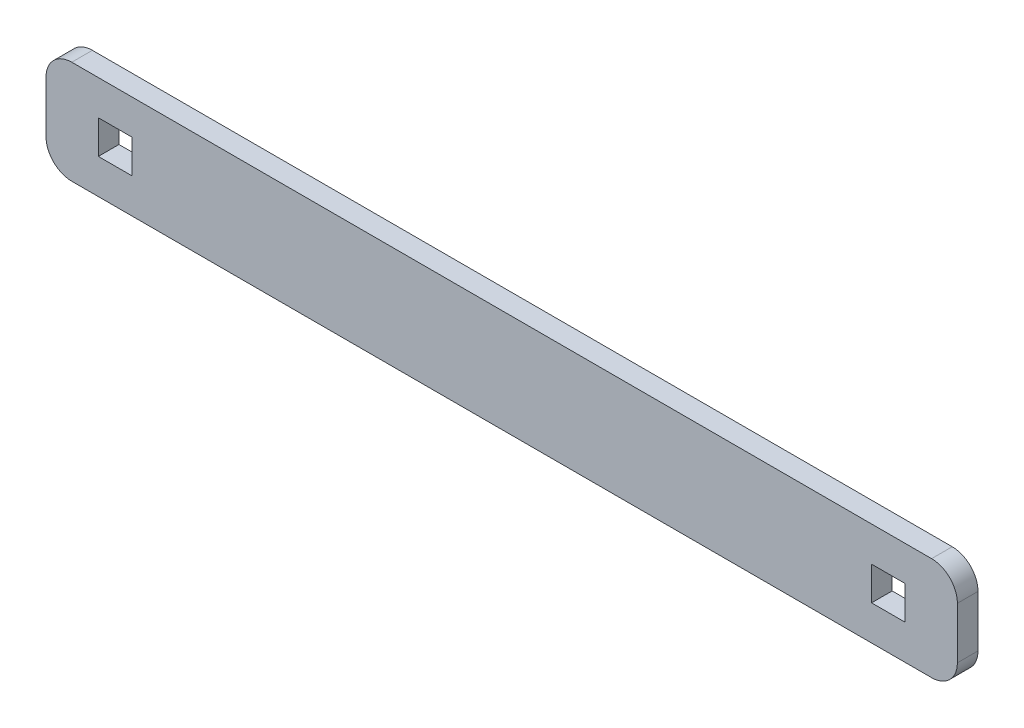
ISO-10303-21;
HEADER;
FILE_DESCRIPTION(('STEP AP214'),'2;1');
FILE_NAME('part.step','',(''),(''),'','','');
FILE_SCHEMA(('AUTOMOTIVE_DESIGN { 1 0 10303 214 1 1 1 1 }'));
ENDSEC;
DATA;
#1=APPLICATION_CONTEXT('core data for automotive mechanical design processes');
#2=APPLICATION_PROTOCOL_DEFINITION('international standard','automotive_design',2000,#1);
#3=PRODUCT_CONTEXT('',#1,'mechanical');
#4=PRODUCT('Part','Part','',(#3));
#5=PRODUCT_RELATED_PRODUCT_CATEGORY('part','',(#4));
#6=PRODUCT_DEFINITION_FORMATION('','',#4);
#7=PRODUCT_DEFINITION_CONTEXT('part definition',#1,'design');
#8=PRODUCT_DEFINITION('design','',#6,#7);
#9=PRODUCT_DEFINITION_SHAPE('','',#8);
#10=(LENGTH_UNIT() NAMED_UNIT(*) SI_UNIT(.MILLI.,.METRE.));
#11=(NAMED_UNIT(*) PLANE_ANGLE_UNIT() SI_UNIT($,.RADIAN.));
#12=(NAMED_UNIT(*) SI_UNIT($,.STERADIAN.) SOLID_ANGLE_UNIT());
#13=UNCERTAINTY_MEASURE_WITH_UNIT(LENGTH_MEASURE(1.E-05),#10,'distance_accuracy_value','');
#14=(GEOMETRIC_REPRESENTATION_CONTEXT(3) GLOBAL_UNCERTAINTY_ASSIGNED_CONTEXT((#13)) GLOBAL_UNIT_ASSIGNED_CONTEXT((#10,
#11,#12)) REPRESENTATION_CONTEXT('',''));
#15=CARTESIAN_POINT('',(0.,0.,0.));
#16=DIRECTION('',(0.,0.,1.));
#17=DIRECTION('',(1.,0.,0.));
#18=AXIS2_PLACEMENT_3D('',#15,#16,#17);
#19=CARTESIAN_POINT('',(-88.4,-10.,-4.));
#20=DIRECTION('',(-1.,0.,0.));
#21=DIRECTION('',(0.,-1.,0.));
#22=AXIS2_PLACEMENT_3D('',#19,#20,#21);
#23=PLANE('',#22);
#24=DIRECTION('',(0.,-1.,0.));
#25=VECTOR('',#24,1.);
#26=CARTESIAN_POINT('',(-88.4,-10.,-4.));
#27=LINE('',#26,#25);
#28=CARTESIAN_POINT('',(-88.4,5.,-4.));
#29=VERTEX_POINT('',#28);
#30=CARTESIAN_POINT('',(-88.4,-5.,-4.));
#31=VERTEX_POINT('',#30);
#32=EDGE_CURVE('E255',#29,#31,#27,.T.);
#33=ORIENTED_EDGE('',*,*,#32,.T.);
#34=DIRECTION('',(0.,0.,1.));
#35=VECTOR('',#34,1.);
#36=CARTESIAN_POINT('',(-88.4,-5.,-4.));
#37=LINE('',#36,#35);
#38=CARTESIAN_POINT('',(-88.4,-5.,0.));
#39=VERTEX_POINT('',#38);
#40=EDGE_CURVE('E288',#31,#39,#37,.T.);
#41=ORIENTED_EDGE('',*,*,#40,.T.);
#42=DIRECTION('',(0.,-1.,0.));
#43=VECTOR('',#42,1.);
#44=CARTESIAN_POINT('',(-88.4,-10.,0.));
#45=LINE('',#44,#43);
#46=CARTESIAN_POINT('',(-88.4,5.,0.));
#47=VERTEX_POINT('',#46);
#48=EDGE_CURVE('E245',#47,#39,#45,.T.);
#49=ORIENTED_EDGE('',*,*,#48,.F.);
#50=DIRECTION('',(0.,0.,1.));
#51=VECTOR('',#50,1.);
#52=CARTESIAN_POINT('',(-88.4,5.,-4.));
#53=LINE('',#52,#51);
#54=EDGE_CURVE('E271',#47,#29,#53,.F.);
#55=ORIENTED_EDGE('',*,*,#54,.T.);
#56=EDGE_LOOP('',(#33,#41,#49,#55));
#57=FACE_BOUND('',#56,.T.);
#58=ADVANCED_FACE('F40',(#57),#23,.T.);
#59=CARTESIAN_POINT('',(88.4,10.,-4.));
#60=DIRECTION('',(0.,1.,0.));
#61=DIRECTION('',(0.,0.,1.));
#62=AXIS2_PLACEMENT_3D('',#59,#60,#61);
#63=PLANE('',#62);
#64=DIRECTION('',(-1.,0.,0.));
#65=VECTOR('',#64,1.);
#66=CARTESIAN_POINT('',(88.4,10.,-4.));
#67=LINE('',#66,#65);
#68=CARTESIAN_POINT('',(83.4,10.,-4.));
#69=VERTEX_POINT('',#68);
#70=CARTESIAN_POINT('',(-83.4,10.,-4.));
#71=VERTEX_POINT('',#70);
#72=EDGE_CURVE('E267',#69,#71,#67,.T.);
#73=ORIENTED_EDGE('',*,*,#72,.T.);
#74=DIRECTION('',(0.,0.,1.));
#75=VECTOR('',#74,1.);
#76=CARTESIAN_POINT('',(-83.4,10.,-4.));
#77=LINE('',#76,#75);
#78=CARTESIAN_POINT('',(-83.4,10.,0.));
#79=VERTEX_POINT('',#78);
#80=EDGE_CURVE('E325',#71,#79,#77,.T.);
#81=ORIENTED_EDGE('',*,*,#80,.T.);
#82=DIRECTION('',(-1.,0.,0.));
#83=VECTOR('',#82,1.);
#84=CARTESIAN_POINT('',(88.4,10.,0.));
#85=LINE('',#84,#83);
#86=CARTESIAN_POINT('',(83.4,10.,0.));
#87=VERTEX_POINT('',#86);
#88=EDGE_CURVE('E260',#87,#79,#85,.T.);
#89=ORIENTED_EDGE('',*,*,#88,.F.);
#90=DIRECTION('',(0.,0.,1.));
#91=VECTOR('',#90,1.);
#92=CARTESIAN_POINT('',(83.4,10.,-4.));
#93=LINE('',#92,#91);
#94=EDGE_CURVE('E322',#87,#69,#93,.F.);
#95=ORIENTED_EDGE('',*,*,#94,.T.);
#96=EDGE_LOOP('',(#73,#81,#89,#95));
#97=FACE_BOUND('',#96,.T.);
#98=ADVANCED_FACE('F359',(#97),#63,.T.);
#99=CARTESIAN_POINT('',(88.4,-10.,-4.));
#100=DIRECTION('',(1.,0.,0.));
#101=DIRECTION('',(0.,1.,0.));
#102=AXIS2_PLACEMENT_3D('',#99,#100,#101);
#103=PLANE('',#102);
#104=DIRECTION('',(0.,1.,0.));
#105=VECTOR('',#104,1.);
#106=CARTESIAN_POINT('',(88.4,-10.,0.));
#107=LINE('',#106,#105);
#108=CARTESIAN_POINT('',(88.4,-5.,0.));
#109=VERTEX_POINT('',#108);
#110=CARTESIAN_POINT('',(88.4,5.,0.));
#111=VERTEX_POINT('',#110);
#112=EDGE_CURVE('E279',#109,#111,#107,.T.);
#113=ORIENTED_EDGE('',*,*,#112,.F.);
#114=DIRECTION('',(0.,0.,1.));
#115=VECTOR('',#114,1.);
#116=CARTESIAN_POINT('',(88.4,-5.,-4.));
#117=LINE('',#116,#115);
#118=CARTESIAN_POINT('',(88.4,-5.,-4.));
#119=VERTEX_POINT('',#118);
#120=EDGE_CURVE('E11',#109,#119,#117,.F.);
#121=ORIENTED_EDGE('',*,*,#120,.T.);
#122=DIRECTION('',(0.,1.,0.));
#123=VECTOR('',#122,1.);
#124=CARTESIAN_POINT('',(88.4,-10.,-4.));
#125=LINE('',#124,#123);
#126=CARTESIAN_POINT('',(88.4,5.,-4.));
#127=VERTEX_POINT('',#126);
#128=EDGE_CURVE('E264',#119,#127,#125,.T.);
#129=ORIENTED_EDGE('',*,*,#128,.T.);
#130=DIRECTION('',(0.,0.,1.));
#131=VECTOR('',#130,1.);
#132=CARTESIAN_POINT('',(88.4,5.,-4.));
#133=LINE('',#132,#131);
#134=EDGE_CURVE('E49',#127,#111,#133,.T.);
#135=ORIENTED_EDGE('',*,*,#134,.T.);
#136=EDGE_LOOP('',(#113,#121,#129,#135));
#137=FACE_BOUND('',#136,.T.);
#138=ADVANCED_FACE('F332',(#137),#103,.T.);
#139=CARTESIAN_POINT('',(88.4,-10.,-4.));
#140=DIRECTION('',(0.,-1.,0.));
#141=DIRECTION('',(0.,0.,-1.));
#142=AXIS2_PLACEMENT_3D('',#139,#140,#141);
#143=PLANE('',#142);
#144=DIRECTION('',(1.,0.,0.));
#145=VECTOR('',#144,1.);
#146=CARTESIAN_POINT('',(88.4,-10.,0.));
#147=LINE('',#146,#145);
#148=CARTESIAN_POINT('',(-83.4,-10.,0.));
#149=VERTEX_POINT('',#148);
#150=CARTESIAN_POINT('',(83.4,-10.,0.));
#151=VERTEX_POINT('',#150);
#152=EDGE_CURVE('E275',#149,#151,#147,.T.);
#153=ORIENTED_EDGE('',*,*,#152,.F.);
#154=DIRECTION('',(0.,0.,1.));
#155=VECTOR('',#154,1.);
#156=CARTESIAN_POINT('',(-83.4,-10.,-4.));
#157=LINE('',#156,#155);
#158=CARTESIAN_POINT('',(-83.4,-10.,-4.));
#159=VERTEX_POINT('',#158);
#160=EDGE_CURVE('E308',#149,#159,#157,.F.);
#161=ORIENTED_EDGE('',*,*,#160,.T.);
#162=DIRECTION('',(1.,0.,0.));
#163=VECTOR('',#162,1.);
#164=CARTESIAN_POINT('',(88.4,-10.,-4.));
#165=LINE('',#164,#163);
#166=CARTESIAN_POINT('',(83.4,-10.,-4.));
#167=VERTEX_POINT('',#166);
#168=EDGE_CURVE('E259',#159,#167,#165,.T.);
#169=ORIENTED_EDGE('',*,*,#168,.T.);
#170=DIRECTION('',(0.,0.,1.));
#171=VECTOR('',#170,1.);
#172=CARTESIAN_POINT('',(83.4,-10.,-4.));
#173=LINE('',#172,#171);
#174=EDGE_CURVE('E304',#167,#151,#173,.T.);
#175=ORIENTED_EDGE('',*,*,#174,.T.);
#176=EDGE_LOOP('',(#153,#161,#169,#175));
#177=FACE_BOUND('',#176,.T.);
#178=ADVANCED_FACE('F343',(#177),#143,.T.);
#179=CARTESIAN_POINT('',(0.,0.,-4.));
#180=DIRECTION('',(0.,0.,1.));
#181=DIRECTION('',(1.,0.,0.));
#182=AXIS2_PLACEMENT_3D('',#179,#180,#181);
#183=PLANE('',#182);
#184=DIRECTION('',(1.,0.,0.));
#185=VECTOR('',#184,1.);
#186=CARTESIAN_POINT('',(78.25,-3.25,-4.));
#187=LINE('',#186,#185);
#188=CARTESIAN_POINT('',(71.75,-3.25,-4.));
#189=VERTEX_POINT('',#188);
#190=CARTESIAN_POINT('',(78.25,-3.25,-4.));
#191=VERTEX_POINT('',#190);
#192=EDGE_CURVE('E167',#189,#191,#187,.T.);
#193=ORIENTED_EDGE('',*,*,#192,.T.);
#194=DIRECTION('',(0.,1.,0.));
#195=VECTOR('',#194,1.);
#196=CARTESIAN_POINT('',(78.25,-3.25,-4.));
#197=LINE('',#196,#195);
#198=CARTESIAN_POINT('',(78.25,3.25,-4.));
#199=VERTEX_POINT('',#198);
#200=EDGE_CURVE('E158',#191,#199,#197,.T.);
#201=ORIENTED_EDGE('',*,*,#200,.T.);
#202=DIRECTION('',(-1.,0.,0.));
#203=VECTOR('',#202,1.);
#204=CARTESIAN_POINT('',(78.25,3.25,-4.));
#205=LINE('',#204,#203);
#206=CARTESIAN_POINT('',(71.75,3.25,-4.));
#207=VERTEX_POINT('',#206);
#208=EDGE_CURVE('E171',#199,#207,#205,.T.);
#209=ORIENTED_EDGE('',*,*,#208,.T.);
#210=DIRECTION('',(0.,-1.,0.));
#211=VECTOR('',#210,1.);
#212=CARTESIAN_POINT('',(71.75,-3.25,-4.));
#213=LINE('',#212,#211);
#214=EDGE_CURVE('E176',#207,#189,#213,.T.);
#215=ORIENTED_EDGE('',*,*,#214,.T.);
#216=EDGE_LOOP('',(#193,#201,#209,#215));
#217=FACE_BOUND('',#216,.T.);
#218=DIRECTION('',(1.,0.,0.));
#219=VECTOR('',#218,1.);
#220=CARTESIAN_POINT('',(-78.25,-3.25,-4.));
#221=LINE('',#220,#219);
#222=CARTESIAN_POINT('',(-78.25,-3.25,-4.));
#223=VERTEX_POINT('',#222);
#224=CARTESIAN_POINT('',(-71.75,-3.25,-4.));
#225=VERTEX_POINT('',#224);
#226=EDGE_CURVE('E224',#223,#225,#221,.T.);
#227=ORIENTED_EDGE('',*,*,#226,.T.);
#228=DIRECTION('',(0.,1.,0.));
#229=VECTOR('',#228,1.);
#230=CARTESIAN_POINT('',(-71.75,-3.25,-4.));
#231=LINE('',#230,#229);
#232=CARTESIAN_POINT('',(-71.75,3.25,-4.));
#233=VERTEX_POINT('',#232);
#234=EDGE_CURVE('E211',#225,#233,#231,.T.);
#235=ORIENTED_EDGE('',*,*,#234,.T.);
#236=DIRECTION('',(-1.,0.,0.));
#237=VECTOR('',#236,1.);
#238=CARTESIAN_POINT('',(-78.25,3.25,-4.));
#239=LINE('',#238,#237);
#240=CARTESIAN_POINT('',(-78.25,3.25,-4.));
#241=VERTEX_POINT('',#240);
#242=EDGE_CURVE('E215',#233,#241,#239,.T.);
#243=ORIENTED_EDGE('',*,*,#242,.T.);
#244=DIRECTION('',(0.,-1.,0.));
#245=VECTOR('',#244,1.);
#246=CARTESIAN_POINT('',(-78.25,-3.25,-4.));
#247=LINE('',#246,#245);
#248=EDGE_CURVE('E220',#241,#223,#247,.T.);
#249=ORIENTED_EDGE('',*,*,#248,.T.);
#250=EDGE_LOOP('',(#227,#235,#243,#249));
#251=FACE_BOUND('',#250,.T.);
#252=ORIENTED_EDGE('',*,*,#168,.F.);
#253=CARTESIAN_POINT('',(-83.4,-5.,-4.));
#254=DIRECTION('',(0.,0.,1.));
#255=DIRECTION('',(1.,0.,0.));
#256=AXIS2_PLACEMENT_3D('',#253,#254,#255);
#257=CIRCLE('',#256,5.);
#258=EDGE_CURVE('E319',#159,#31,#257,.F.);
#259=ORIENTED_EDGE('',*,*,#258,.T.);
#260=ORIENTED_EDGE('',*,*,#32,.F.);
#261=CARTESIAN_POINT('',(-83.4,5.,-4.));
#262=DIRECTION('',(0.,0.,1.));
#263=DIRECTION('',(1.,0.,0.));
#264=AXIS2_PLACEMENT_3D('',#261,#262,#263);
#265=CIRCLE('',#264,5.);
#266=EDGE_CURVE('E316',#29,#71,#265,.F.);
#267=ORIENTED_EDGE('',*,*,#266,.T.);
#268=ORIENTED_EDGE('',*,*,#72,.F.);
#269=CARTESIAN_POINT('',(83.4,5.,-4.));
#270=DIRECTION('',(0.,0.,1.));
#271=DIRECTION('',(1.,0.,0.));
#272=AXIS2_PLACEMENT_3D('',#269,#270,#271);
#273=CIRCLE('',#272,5.);
#274=EDGE_CURVE('E56',#69,#127,#273,.F.);
#275=ORIENTED_EDGE('',*,*,#274,.T.);
#276=ORIENTED_EDGE('',*,*,#128,.F.);
#277=CARTESIAN_POINT('',(83.4,-5.,-4.));
#278=DIRECTION('',(0.,0.,1.));
#279=DIRECTION('',(1.,0.,0.));
#280=AXIS2_PLACEMENT_3D('',#277,#278,#279);
#281=CIRCLE('',#280,5.);
#282=EDGE_CURVE('E313',#119,#167,#281,.F.);
#283=ORIENTED_EDGE('',*,*,#282,.T.);
#284=EDGE_LOOP('',(#252,#259,#260,#267,#268,#275,#276,#283));
#285=FACE_BOUND('',#284,.T.);
#286=ADVANCED_FACE('F178',(#217,#251,#285),#183,.F.);
#287=CARTESIAN_POINT('',(0.,0.,0.));
#288=DIRECTION('',(0.,0.,1.));
#289=DIRECTION('',(1.,0.,0.));
#290=AXIS2_PLACEMENT_3D('',#287,#288,#289);
#291=PLANE('',#290);
#292=DIRECTION('',(0.,1.,0.));
#293=VECTOR('',#292,1.);
#294=CARTESIAN_POINT('',(78.25,-3.25,0.));
#295=LINE('',#294,#293);
#296=CARTESIAN_POINT('',(78.25,-3.25,0.));
#297=VERTEX_POINT('',#296);
#298=CARTESIAN_POINT('',(78.25,3.25,0.));
#299=VERTEX_POINT('',#298);
#300=EDGE_CURVE('E161',#297,#299,#295,.T.);
#301=ORIENTED_EDGE('',*,*,#300,.F.);
#302=DIRECTION('',(1.,0.,0.));
#303=VECTOR('',#302,1.);
#304=CARTESIAN_POINT('',(78.25,-3.25,0.));
#305=LINE('',#304,#303);
#306=CARTESIAN_POINT('',(71.75,-3.25,0.));
#307=VERTEX_POINT('',#306);
#308=EDGE_CURVE('E182',#307,#297,#305,.T.);
#309=ORIENTED_EDGE('',*,*,#308,.F.);
#310=DIRECTION('',(0.,-1.,0.));
#311=VECTOR('',#310,1.);
#312=CARTESIAN_POINT('',(71.75,-3.25,0.));
#313=LINE('',#312,#311);
#314=CARTESIAN_POINT('',(71.75,3.25,0.));
#315=VERTEX_POINT('',#314);
#316=EDGE_CURVE('E187',#315,#307,#313,.T.);
#317=ORIENTED_EDGE('',*,*,#316,.F.);
#318=DIRECTION('',(-1.,0.,0.));
#319=VECTOR('',#318,1.);
#320=CARTESIAN_POINT('',(78.25,3.25,0.));
#321=LINE('',#320,#319);
#322=EDGE_CURVE('E196',#299,#315,#321,.T.);
#323=ORIENTED_EDGE('',*,*,#322,.F.);
#324=EDGE_LOOP('',(#301,#309,#317,#323));
#325=FACE_BOUND('',#324,.T.);
#326=DIRECTION('',(0.,1.,0.));
#327=VECTOR('',#326,1.);
#328=CARTESIAN_POINT('',(-71.75,-3.25,0.));
#329=LINE('',#328,#327);
#330=CARTESIAN_POINT('',(-71.75,-3.25,0.));
#331=VERTEX_POINT('',#330);
#332=CARTESIAN_POINT('',(-71.75,3.25,0.));
#333=VERTEX_POINT('',#332);
#334=EDGE_CURVE('E205',#331,#333,#329,.T.);
#335=ORIENTED_EDGE('',*,*,#334,.F.);
#336=DIRECTION('',(1.,0.,0.));
#337=VECTOR('',#336,1.);
#338=CARTESIAN_POINT('',(-78.25,-3.25,0.));
#339=LINE('',#338,#337);
#340=CARTESIAN_POINT('',(-78.25,-3.25,0.));
#341=VERTEX_POINT('',#340);
#342=EDGE_CURVE('E216',#341,#331,#339,.T.);
#343=ORIENTED_EDGE('',*,*,#342,.F.);
#344=DIRECTION('',(0.,-1.,0.));
#345=VECTOR('',#344,1.);
#346=CARTESIAN_POINT('',(-78.25,-3.25,0.));
#347=LINE('',#346,#345);
#348=CARTESIAN_POINT('',(-78.25,3.25,0.));
#349=VERTEX_POINT('',#348);
#350=EDGE_CURVE('E235',#349,#341,#347,.T.);
#351=ORIENTED_EDGE('',*,*,#350,.F.);
#352=DIRECTION('',(-1.,0.,0.));
#353=VECTOR('',#352,1.);
#354=CARTESIAN_POINT('',(-78.25,3.25,0.));
#355=LINE('',#354,#353);
#356=EDGE_CURVE('E231',#333,#349,#355,.T.);
#357=ORIENTED_EDGE('',*,*,#356,.F.);
#358=EDGE_LOOP('',(#335,#343,#351,#357));
#359=FACE_BOUND('',#358,.T.);
#360=ORIENTED_EDGE('',*,*,#48,.T.);
#361=CARTESIAN_POINT('',(-83.4,-5.,0.));
#362=DIRECTION('',(0.,0.,1.));
#363=DIRECTION('',(1.,0.,0.));
#364=AXIS2_PLACEMENT_3D('',#361,#362,#363);
#365=CIRCLE('',#364,5.);
#366=EDGE_CURVE('E301',#39,#149,#365,.T.);
#367=ORIENTED_EDGE('',*,*,#366,.T.);
#368=ORIENTED_EDGE('',*,*,#152,.T.);
#369=CARTESIAN_POINT('',(83.4,-5.,0.));
#370=DIRECTION('',(0.,0.,1.));
#371=DIRECTION('',(1.,0.,0.));
#372=AXIS2_PLACEMENT_3D('',#369,#370,#371);
#373=CIRCLE('',#372,5.);
#374=EDGE_CURVE('E295',#151,#109,#373,.T.);
#375=ORIENTED_EDGE('',*,*,#374,.T.);
#376=ORIENTED_EDGE('',*,*,#112,.T.);
#377=CARTESIAN_POINT('',(83.4,5.,0.));
#378=DIRECTION('',(0.,0.,1.));
#379=DIRECTION('',(1.,0.,0.));
#380=AXIS2_PLACEMENT_3D('',#377,#378,#379);
#381=CIRCLE('',#380,5.);
#382=EDGE_CURVE('E292',#111,#87,#381,.T.);
#383=ORIENTED_EDGE('',*,*,#382,.T.);
#384=ORIENTED_EDGE('',*,*,#88,.T.);
#385=CARTESIAN_POINT('',(-83.4,5.,0.));
#386=DIRECTION('',(0.,0.,1.));
#387=DIRECTION('',(1.,0.,0.));
#388=AXIS2_PLACEMENT_3D('',#385,#386,#387);
#389=CIRCLE('',#388,5.);
#390=EDGE_CURVE('E298',#79,#47,#389,.T.);
#391=ORIENTED_EDGE('',*,*,#390,.T.);
#392=EDGE_LOOP('',(#360,#367,#368,#375,#376,#383,#384,#391));
#393=FACE_BOUND('',#392,.T.);
#394=ADVANCED_FACE('F335',(#325,#359,#393),#291,.T.);
#395=CARTESIAN_POINT('',(-71.75,-3.25,-4.));
#396=DIRECTION('',(1.,0.,0.));
#397=DIRECTION('',(0.,0.,-1.));
#398=AXIS2_PLACEMENT_3D('',#395,#396,#397);
#399=PLANE('',#398);
#400=ORIENTED_EDGE('',*,*,#334,.T.);
#401=DIRECTION('',(0.,0.,1.));
#402=VECTOR('',#401,1.);
#403=CARTESIAN_POINT('',(-71.75,3.25,-4.));
#404=LINE('',#403,#402);
#405=EDGE_CURVE('E228',#233,#333,#404,.T.);
#406=ORIENTED_EDGE('',*,*,#405,.F.);
#407=ORIENTED_EDGE('',*,*,#234,.F.);
#408=DIRECTION('',(0.,0.,1.));
#409=VECTOR('',#408,1.);
#410=CARTESIAN_POINT('',(-71.75,-3.25,-4.));
#411=LINE('',#410,#409);
#412=EDGE_CURVE('E242',#225,#331,#411,.T.);
#413=ORIENTED_EDGE('',*,*,#412,.T.);
#414=EDGE_LOOP('',(#400,#406,#407,#413));
#415=FACE_BOUND('',#414,.T.);
#416=ADVANCED_FACE('F487',(#415),#399,.F.);
#417=CARTESIAN_POINT('',(-78.25,-3.25,-4.));
#418=DIRECTION('',(0.,-1.,0.));
#419=DIRECTION('',(0.,0.,-1.));
#420=AXIS2_PLACEMENT_3D('',#417,#418,#419);
#421=PLANE('',#420);
#422=ORIENTED_EDGE('',*,*,#342,.T.);
#423=ORIENTED_EDGE('',*,*,#412,.F.);
#424=ORIENTED_EDGE('',*,*,#226,.F.);
#425=DIRECTION('',(0.,0.,1.));
#426=VECTOR('',#425,1.);
#427=CARTESIAN_POINT('',(-78.25,-3.25,-4.));
#428=LINE('',#427,#426);
#429=EDGE_CURVE('E246',#223,#341,#428,.T.);
#430=ORIENTED_EDGE('',*,*,#429,.T.);
#431=EDGE_LOOP('',(#422,#423,#424,#430));
#432=FACE_BOUND('',#431,.T.);
#433=ADVANCED_FACE('F476',(#432),#421,.F.);
#434=CARTESIAN_POINT('',(-78.25,-3.25,-4.));
#435=DIRECTION('',(-1.,0.,0.));
#436=DIRECTION('',(0.,0.,1.));
#437=AXIS2_PLACEMENT_3D('',#434,#435,#436);
#438=PLANE('',#437);
#439=ORIENTED_EDGE('',*,*,#350,.T.);
#440=ORIENTED_EDGE('',*,*,#429,.F.);
#441=ORIENTED_EDGE('',*,*,#248,.F.);
#442=DIRECTION('',(0.,0.,1.));
#443=VECTOR('',#442,1.);
#444=CARTESIAN_POINT('',(-78.25,3.25,-4.));
#445=LINE('',#444,#443);
#446=EDGE_CURVE('E249',#241,#349,#445,.T.);
#447=ORIENTED_EDGE('',*,*,#446,.T.);
#448=EDGE_LOOP('',(#439,#440,#441,#447));
#449=FACE_BOUND('',#448,.T.);
#450=ADVANCED_FACE('F465',(#449),#438,.F.);
#451=CARTESIAN_POINT('',(-78.25,3.25,-4.));
#452=DIRECTION('',(0.,1.,0.));
#453=DIRECTION('',(0.,0.,1.));
#454=AXIS2_PLACEMENT_3D('',#451,#452,#453);
#455=PLANE('',#454);
#456=ORIENTED_EDGE('',*,*,#356,.T.);
#457=ORIENTED_EDGE('',*,*,#446,.F.);
#458=ORIENTED_EDGE('',*,*,#242,.F.);
#459=ORIENTED_EDGE('',*,*,#405,.T.);
#460=EDGE_LOOP('',(#456,#457,#458,#459));
#461=FACE_BOUND('',#460,.T.);
#462=ADVANCED_FACE('F455',(#461),#455,.F.);
#463=CARTESIAN_POINT('',(78.25,-3.25,-4.));
#464=DIRECTION('',(1.,0.,0.));
#465=DIRECTION('',(0.,0.,-1.));
#466=AXIS2_PLACEMENT_3D('',#463,#464,#465);
#467=PLANE('',#466);
#468=ORIENTED_EDGE('',*,*,#300,.T.);
#469=DIRECTION('',(0.,0.,1.));
#470=VECTOR('',#469,1.);
#471=CARTESIAN_POINT('',(78.25,3.25,-4.));
#472=LINE('',#471,#470);
#473=EDGE_CURVE('E154',#199,#299,#472,.T.);
#474=ORIENTED_EDGE('',*,*,#473,.F.);
#475=ORIENTED_EDGE('',*,*,#200,.F.);
#476=DIRECTION('',(0.,0.,1.));
#477=VECTOR('',#476,1.);
#478=CARTESIAN_POINT('',(78.25,-3.25,-4.));
#479=LINE('',#478,#477);
#480=EDGE_CURVE('E202',#191,#297,#479,.T.);
#481=ORIENTED_EDGE('',*,*,#480,.T.);
#482=EDGE_LOOP('',(#468,#474,#475,#481));
#483=FACE_BOUND('',#482,.T.);
#484=ADVANCED_FACE('F156',(#483),#467,.F.);
#485=CARTESIAN_POINT('',(78.25,-3.25,-4.));
#486=DIRECTION('',(0.,-1.,0.));
#487=DIRECTION('',(0.,0.,-1.));
#488=AXIS2_PLACEMENT_3D('',#485,#486,#487);
#489=PLANE('',#488);
#490=ORIENTED_EDGE('',*,*,#308,.T.);
#491=ORIENTED_EDGE('',*,*,#480,.F.);
#492=ORIENTED_EDGE('',*,*,#192,.F.);
#493=DIRECTION('',(0.,0.,1.));
#494=VECTOR('',#493,1.);
#495=CARTESIAN_POINT('',(71.75,-3.25,-4.));
#496=LINE('',#495,#494);
#497=EDGE_CURVE('E206',#189,#307,#496,.T.);
#498=ORIENTED_EDGE('',*,*,#497,.T.);
#499=EDGE_LOOP('',(#490,#491,#492,#498));
#500=FACE_BOUND('',#499,.T.);
#501=ADVANCED_FACE('F434',(#500),#489,.F.);
#502=CARTESIAN_POINT('',(71.75,-3.25,-4.));
#503=DIRECTION('',(-1.,0.,0.));
#504=DIRECTION('',(0.,0.,1.));
#505=AXIS2_PLACEMENT_3D('',#502,#503,#504);
#506=PLANE('',#505);
#507=ORIENTED_EDGE('',*,*,#316,.T.);
#508=ORIENTED_EDGE('',*,*,#497,.F.);
#509=ORIENTED_EDGE('',*,*,#214,.F.);
#510=DIRECTION('',(0.,0.,1.));
#511=VECTOR('',#510,1.);
#512=CARTESIAN_POINT('',(71.75,3.25,-4.));
#513=LINE('',#512,#511);
#514=EDGE_CURVE('E166',#207,#315,#513,.T.);
#515=ORIENTED_EDGE('',*,*,#514,.T.);
#516=EDGE_LOOP('',(#507,#508,#509,#515));
#517=FACE_BOUND('',#516,.T.);
#518=ADVANCED_FACE('F424',(#517),#506,.F.);
#519=CARTESIAN_POINT('',(78.25,3.25,-4.));
#520=DIRECTION('',(0.,1.,0.));
#521=DIRECTION('',(0.,0.,1.));
#522=AXIS2_PLACEMENT_3D('',#519,#520,#521);
#523=PLANE('',#522);
#524=ORIENTED_EDGE('',*,*,#322,.T.);
#525=ORIENTED_EDGE('',*,*,#514,.F.);
#526=ORIENTED_EDGE('',*,*,#208,.F.);
#527=ORIENTED_EDGE('',*,*,#473,.T.);
#528=EDGE_LOOP('',(#524,#525,#526,#527));
#529=FACE_BOUND('',#528,.T.);
#530=ADVANCED_FACE('F172',(#529),#523,.F.);
#531=CARTESIAN_POINT('',(-83.4,-5.,-4.));
#532=DIRECTION('',(0.,0.,1.));
#533=DIRECTION('',(1.,0.,0.));
#534=AXIS2_PLACEMENT_3D('',#531,#532,#533);
#535=CYLINDRICAL_SURFACE('',#534,5.);
#536=ORIENTED_EDGE('',*,*,#258,.F.);
#537=ORIENTED_EDGE('',*,*,#160,.F.);
#538=ORIENTED_EDGE('',*,*,#366,.F.);
#539=ORIENTED_EDGE('',*,*,#40,.F.);
#540=EDGE_LOOP('',(#536,#537,#538,#539));
#541=FACE_BOUND('',#540,.T.);
#542=ADVANCED_FACE('F350',(#541),#535,.T.);
#543=CARTESIAN_POINT('',(-83.4,5.,-4.));
#544=DIRECTION('',(0.,0.,1.));
#545=DIRECTION('',(1.,0.,0.));
#546=AXIS2_PLACEMENT_3D('',#543,#544,#545);
#547=CYLINDRICAL_SURFACE('',#546,5.);
#548=ORIENTED_EDGE('',*,*,#266,.F.);
#549=ORIENTED_EDGE('',*,*,#54,.F.);
#550=ORIENTED_EDGE('',*,*,#390,.F.);
#551=ORIENTED_EDGE('',*,*,#80,.F.);
#552=EDGE_LOOP('',(#548,#549,#550,#551));
#553=FACE_BOUND('',#552,.T.);
#554=ADVANCED_FACE('F357',(#553),#547,.T.);
#555=CARTESIAN_POINT('',(83.4,-5.,-4.));
#556=DIRECTION('',(0.,0.,1.));
#557=DIRECTION('',(1.,0.,0.));
#558=AXIS2_PLACEMENT_3D('',#555,#556,#557);
#559=CYLINDRICAL_SURFACE('',#558,5.);
#560=ORIENTED_EDGE('',*,*,#282,.F.);
#561=ORIENTED_EDGE('',*,*,#120,.F.);
#562=ORIENTED_EDGE('',*,*,#374,.F.);
#563=ORIENTED_EDGE('',*,*,#174,.F.);
#564=EDGE_LOOP('',(#560,#561,#562,#563));
#565=FACE_BOUND('',#564,.T.);
#566=ADVANCED_FACE('F341',(#565),#559,.T.);
#567=CARTESIAN_POINT('',(83.4,5.,-4.));
#568=DIRECTION('',(0.,0.,1.));
#569=DIRECTION('',(1.,0.,0.));
#570=AXIS2_PLACEMENT_3D('',#567,#568,#569);
#571=CYLINDRICAL_SURFACE('',#570,5.);
#572=ORIENTED_EDGE('',*,*,#274,.F.);
#573=ORIENTED_EDGE('',*,*,#94,.F.);
#574=ORIENTED_EDGE('',*,*,#382,.F.);
#575=ORIENTED_EDGE('',*,*,#134,.F.);
#576=EDGE_LOOP('',(#572,#573,#574,#575));
#577=FACE_BOUND('',#576,.T.);
#578=ADVANCED_FACE('F42',(#577),#571,.T.);
#579=CLOSED_SHELL('',(#58,#98,#138,#178,#286,#394,#416,#433,#450,#462,#484,#501,#518,#530,#542,
#554,#566,#578));
#580=MANIFOLD_SOLID_BREP('B2',#579);
#581=ADVANCED_BREP_SHAPE_REPRESENTATION('',(#18,#580),#14);
#582=SHAPE_DEFINITION_REPRESENTATION(#9,#581);
ENDSEC;
END-ISO-10303-21;
